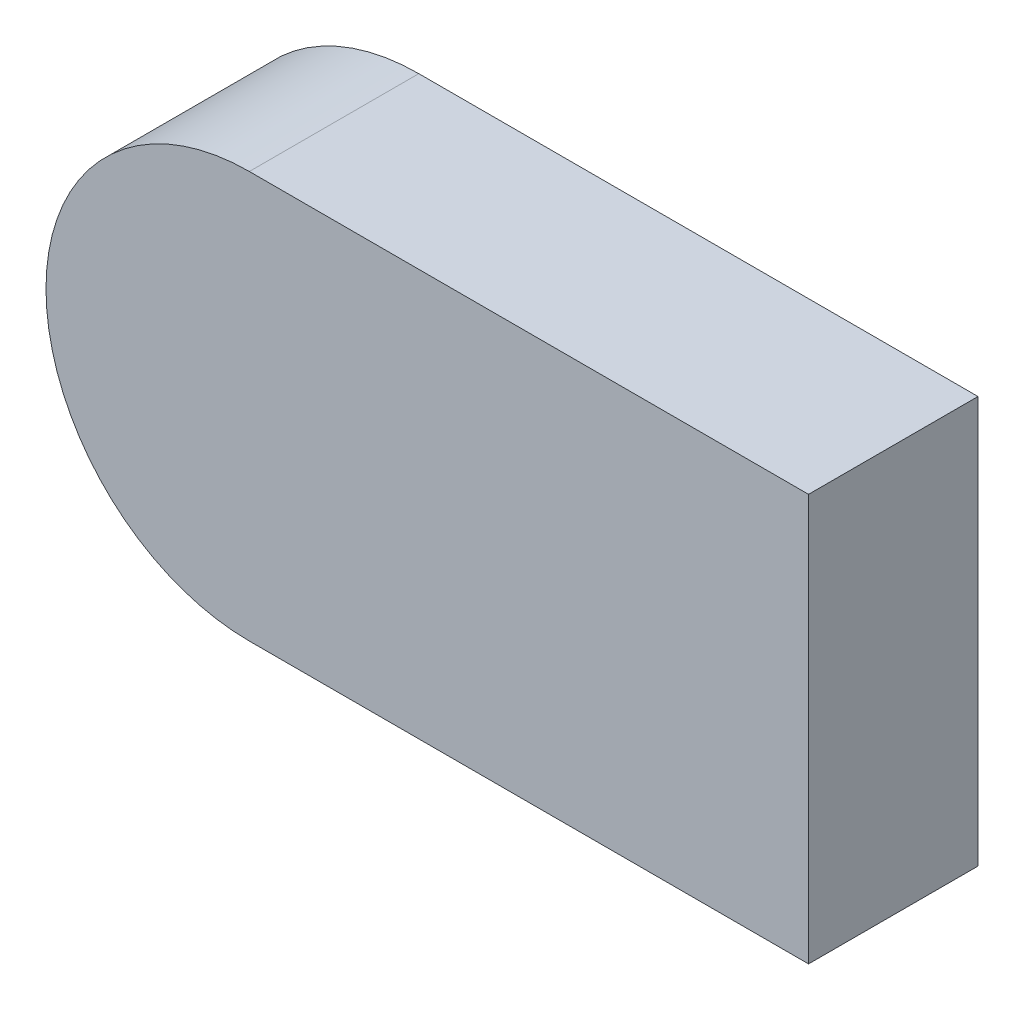
ISO-10303-21;
HEADER;
FILE_DESCRIPTION(('STEP AP214'),'2;1');
FILE_NAME('part.step','',(''),(''),'','','');
FILE_SCHEMA(('AUTOMOTIVE_DESIGN { 1 0 10303 214 1 1 1 1 }'));
ENDSEC;
DATA;
#1=APPLICATION_CONTEXT('core data for automotive mechanical design processes');
#2=APPLICATION_PROTOCOL_DEFINITION('international standard','automotive_design',2000,#1);
#3=PRODUCT_CONTEXT('',#1,'mechanical');
#4=PRODUCT('Part','Part','',(#3));
#5=PRODUCT_RELATED_PRODUCT_CATEGORY('part','',(#4));
#6=PRODUCT_DEFINITION_FORMATION('','',#4);
#7=PRODUCT_DEFINITION_CONTEXT('part definition',#1,'design');
#8=PRODUCT_DEFINITION('design','',#6,#7);
#9=PRODUCT_DEFINITION_SHAPE('','',#8);
#10=(LENGTH_UNIT() NAMED_UNIT(*) SI_UNIT(.MILLI.,.METRE.));
#11=(NAMED_UNIT(*) PLANE_ANGLE_UNIT() SI_UNIT($,.RADIAN.));
#12=(NAMED_UNIT(*) SI_UNIT($,.STERADIAN.) SOLID_ANGLE_UNIT());
#13=UNCERTAINTY_MEASURE_WITH_UNIT(LENGTH_MEASURE(1.E-05),#10,'distance_accuracy_value','');
#14=(GEOMETRIC_REPRESENTATION_CONTEXT(3) GLOBAL_UNCERTAINTY_ASSIGNED_CONTEXT((#13)) GLOBAL_UNIT_ASSIGNED_CONTEXT((#10,
#11,#12)) REPRESENTATION_CONTEXT('',''));
#15=CARTESIAN_POINT('',(0.,0.,0.));
#16=DIRECTION('',(0.,0.,1.));
#17=DIRECTION('',(1.,0.,0.));
#18=AXIS2_PLACEMENT_3D('',#15,#16,#17);
#19=CARTESIAN_POINT('',(4.05,2.13,0.));
#20=DIRECTION('',(0.,-1.,0.));
#21=DIRECTION('',(-1.,0.,0.));
#22=AXIS2_PLACEMENT_3D('',#19,#20,#21);
#23=PLANE('',#22);
#24=DIRECTION('',(0.,0.,1.));
#25=VECTOR('',#24,1.);
#26=CARTESIAN_POINT('',(4.05,2.13,0.));
#27=LINE('',#26,#25);
#28=CARTESIAN_POINT('',(4.05,2.13,0.));
#29=VERTEX_POINT('',#28);
#30=CARTESIAN_POINT('',(4.05,2.13,0.1));
#31=VERTEX_POINT('',#30);
#32=EDGE_CURVE('E11',#29,#31,#27,.T.);
#33=ORIENTED_EDGE('',*,*,#32,.T.);
#34=DIRECTION('',(-1.,0.,0.));
#35=VECTOR('',#34,1.);
#36=CARTESIAN_POINT('',(4.05,2.13,0.1));
#37=LINE('',#36,#35);
#38=CARTESIAN_POINT('',(3.72,2.13,0.1));
#39=VERTEX_POINT('',#38);
#40=EDGE_CURVE('E24',#31,#39,#37,.T.);
#41=ORIENTED_EDGE('',*,*,#40,.T.);
#42=DIRECTION('',(0.,0.,1.));
#43=VECTOR('',#42,1.);
#44=CARTESIAN_POINT('',(3.72,2.13,0.));
#45=LINE('',#44,#43);
#46=CARTESIAN_POINT('',(3.72,2.13,0.));
#47=VERTEX_POINT('',#46);
#48=EDGE_CURVE('E86',#47,#39,#45,.T.);
#49=ORIENTED_EDGE('',*,*,#48,.F.);
#50=DIRECTION('',(-1.,0.,0.));
#51=VECTOR('',#50,1.);
#52=CARTESIAN_POINT('',(4.05,2.13,0.));
#53=LINE('',#52,#51);
#54=EDGE_CURVE('E83',#29,#47,#53,.T.);
#55=ORIENTED_EDGE('',*,*,#54,.F.);
#56=EDGE_LOOP('',(#33,#41,#49,#55));
#57=FACE_BOUND('',#56,.T.);
#58=ADVANCED_FACE('F17',(#57),#23,.T.);
#59=CARTESIAN_POINT('',(3.72,2.25,0.));
#60=DIRECTION('',(0.,0.,-1.));
#61=DIRECTION('',(1.,0.,0.));
#62=AXIS2_PLACEMENT_3D('',#59,#60,#61);
#63=CYLINDRICAL_SURFACE('',#62,0.12);
#64=CARTESIAN_POINT('',(3.72,2.25,0.));
#65=DIRECTION('',(0.,0.,1.));
#66=DIRECTION('',(1.,0.,0.));
#67=AXIS2_PLACEMENT_3D('',#64,#65,#66);
#68=CIRCLE('',#67,0.12);
#69=CARTESIAN_POINT('',(3.72,2.37,0.));
#70=VERTEX_POINT('',#69);
#71=EDGE_CURVE('E80',#70,#47,#68,.T.);
#72=ORIENTED_EDGE('',*,*,#71,.T.);
#73=ORIENTED_EDGE('',*,*,#48,.T.);
#74=CARTESIAN_POINT('',(3.72,2.25,0.1));
#75=DIRECTION('',(0.,0.,1.));
#76=DIRECTION('',(1.,0.,0.));
#77=AXIS2_PLACEMENT_3D('',#74,#75,#76);
#78=CIRCLE('',#77,0.12);
#79=CARTESIAN_POINT('',(3.72,2.37,0.1));
#80=VERTEX_POINT('',#79);
#81=EDGE_CURVE('E78',#80,#39,#78,.T.);
#82=ORIENTED_EDGE('',*,*,#81,.F.);
#83=DIRECTION('',(0.,0.,1.));
#84=VECTOR('',#83,1.);
#85=CARTESIAN_POINT('',(3.72,2.37,0.));
#86=LINE('',#85,#84);
#87=EDGE_CURVE('E67',#70,#80,#86,.T.);
#88=ORIENTED_EDGE('',*,*,#87,.F.);
#89=EDGE_LOOP('',(#72,#73,#82,#88));
#90=FACE_BOUND('',#89,.T.);
#91=ADVANCED_FACE('F89',(#90),#63,.T.);
#92=CARTESIAN_POINT('',(4.05,2.37,0.));
#93=DIRECTION('',(0.,-1.,0.));
#94=DIRECTION('',(-1.,0.,0.));
#95=AXIS2_PLACEMENT_3D('',#92,#93,#94);
#96=PLANE('',#95);
#97=DIRECTION('',(-1.,0.,0.));
#98=VECTOR('',#97,1.);
#99=CARTESIAN_POINT('',(4.05,2.37,0.));
#100=LINE('',#99,#98);
#101=CARTESIAN_POINT('',(4.05,2.37,0.));
#102=VERTEX_POINT('',#101);
#103=EDGE_CURVE('E70',#102,#70,#100,.T.);
#104=ORIENTED_EDGE('',*,*,#103,.T.);
#105=ORIENTED_EDGE('',*,*,#87,.T.);
#106=DIRECTION('',(-1.,0.,0.));
#107=VECTOR('',#106,1.);
#108=CARTESIAN_POINT('',(4.05,2.37,0.1));
#109=LINE('',#108,#107);
#110=CARTESIAN_POINT('',(4.05,2.37,0.1));
#111=VERTEX_POINT('',#110);
#112=EDGE_CURVE('E61',#111,#80,#109,.T.);
#113=ORIENTED_EDGE('',*,*,#112,.F.);
#114=DIRECTION('',(0.,0.,1.));
#115=VECTOR('',#114,1.);
#116=CARTESIAN_POINT('',(4.05,2.37,0.));
#117=LINE('',#116,#115);
#118=EDGE_CURVE('E51',#102,#111,#117,.T.);
#119=ORIENTED_EDGE('',*,*,#118,.F.);
#120=EDGE_LOOP('',(#104,#105,#113,#119));
#121=FACE_BOUND('',#120,.T.);
#122=ADVANCED_FACE('F65',(#121),#96,.F.);
#123=CARTESIAN_POINT('',(4.05,2.13,0.));
#124=DIRECTION('',(-1.,0.,0.));
#125=DIRECTION('',(0.,1.,0.));
#126=AXIS2_PLACEMENT_3D('',#123,#124,#125);
#127=PLANE('',#126);
#128=DIRECTION('',(0.,1.,0.));
#129=VECTOR('',#128,1.);
#130=CARTESIAN_POINT('',(4.05,2.13,0.));
#131=LINE('',#130,#129);
#132=EDGE_CURVE('E57',#29,#102,#131,.T.);
#133=ORIENTED_EDGE('',*,*,#132,.T.);
#134=ORIENTED_EDGE('',*,*,#118,.T.);
#135=DIRECTION('',(0.,1.,0.));
#136=VECTOR('',#135,1.);
#137=CARTESIAN_POINT('',(4.05,2.13,0.1));
#138=LINE('',#137,#136);
#139=EDGE_CURVE('E55',#31,#111,#138,.T.);
#140=ORIENTED_EDGE('',*,*,#139,.F.);
#141=ORIENTED_EDGE('',*,*,#32,.F.);
#142=EDGE_LOOP('',(#133,#134,#140,#141));
#143=FACE_BOUND('',#142,.T.);
#144=ADVANCED_FACE('F53',(#143),#127,.F.);
#145=CARTESIAN_POINT('',(3.849490847913,2.25,0.));
#146=DIRECTION('',(0.,0.,-1.));
#147=DIRECTION('',(-1.,0.,0.));
#148=AXIS2_PLACEMENT_3D('',#145,#146,#147);
#149=PLANE('',#148);
#150=ORIENTED_EDGE('',*,*,#54,.T.);
#151=ORIENTED_EDGE('',*,*,#71,.F.);
#152=ORIENTED_EDGE('',*,*,#103,.F.);
#153=ORIENTED_EDGE('',*,*,#132,.F.);
#154=EDGE_LOOP('',(#150,#151,#152,#153));
#155=FACE_BOUND('',#154,.T.);
#156=ADVANCED_FACE('F91',(#155),#149,.T.);
#157=CARTESIAN_POINT('',(3.849490847913,2.25,0.1));
#158=DIRECTION('',(0.,0.,-1.));
#159=DIRECTION('',(-1.,0.,0.));
#160=AXIS2_PLACEMENT_3D('',#157,#158,#159);
#161=PLANE('',#160);
#162=ORIENTED_EDGE('',*,*,#139,.T.);
#163=ORIENTED_EDGE('',*,*,#112,.T.);
#164=ORIENTED_EDGE('',*,*,#81,.T.);
#165=ORIENTED_EDGE('',*,*,#40,.F.);
#166=EDGE_LOOP('',(#162,#163,#164,#165));
#167=FACE_BOUND('',#166,.T.);
#168=ADVANCED_FACE('F72',(#167),#161,.F.);
#169=CLOSED_SHELL('',(#58,#91,#122,#144,#156,#168));
#170=MANIFOLD_SOLID_BREP('B1',#169);
#171=ADVANCED_BREP_SHAPE_REPRESENTATION('',(#18,#170),#14);
#172=SHAPE_DEFINITION_REPRESENTATION(#9,#171);
ENDSEC;
END-ISO-10303-21;
